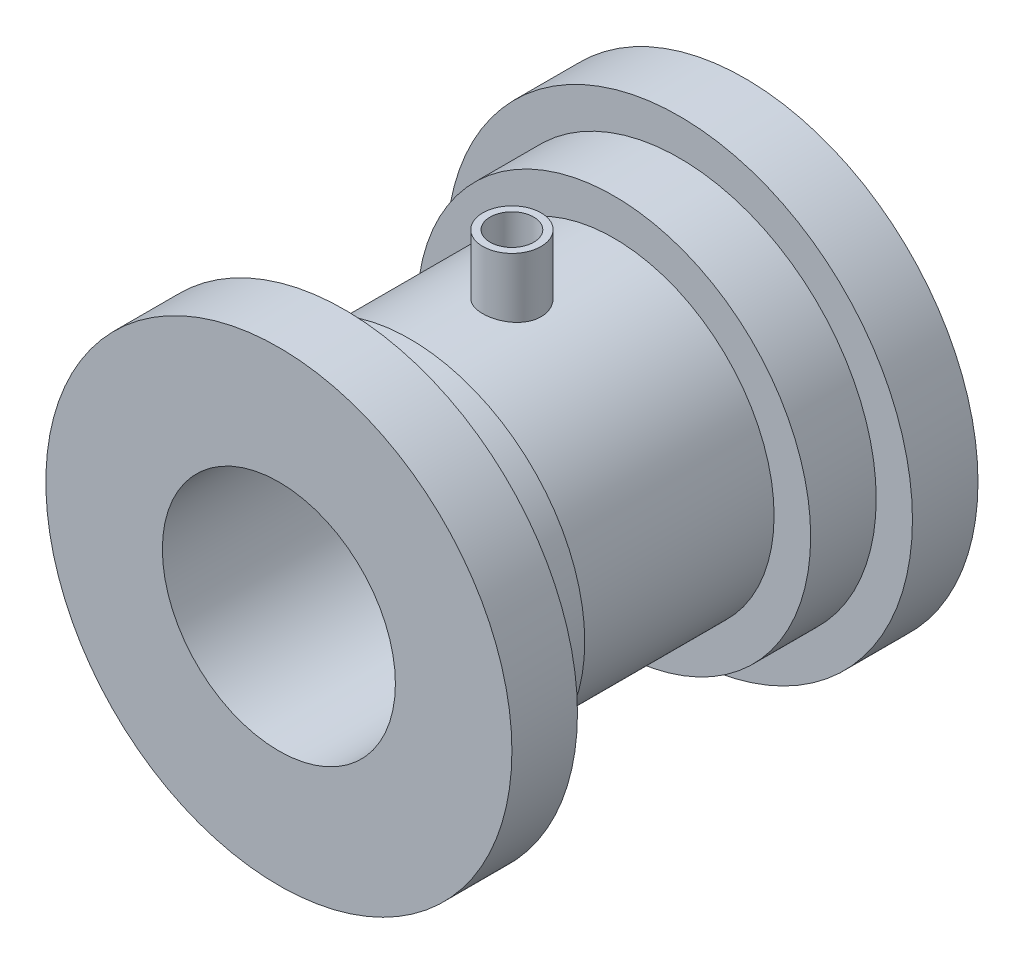
ISO-10303-21;
HEADER;
FILE_DESCRIPTION(('STEP AP214'),'2;1');
FILE_NAME('part.step','',(''),(''),'','','');
FILE_SCHEMA(('AUTOMOTIVE_DESIGN { 1 0 10303 214 1 1 1 1 }'));
ENDSEC;
DATA;
#1=APPLICATION_CONTEXT('core data for automotive mechanical design processes');
#2=APPLICATION_PROTOCOL_DEFINITION('international standard','automotive_design',2000,#1);
#3=PRODUCT_CONTEXT('',#1,'mechanical');
#4=PRODUCT('Part','Part','',(#3));
#5=PRODUCT_RELATED_PRODUCT_CATEGORY('part','',(#4));
#6=PRODUCT_DEFINITION_FORMATION('','',#4);
#7=PRODUCT_DEFINITION_CONTEXT('part definition',#1,'design');
#8=PRODUCT_DEFINITION('design','',#6,#7);
#9=PRODUCT_DEFINITION_SHAPE('','',#8);
#10=(LENGTH_UNIT() NAMED_UNIT(*) SI_UNIT(.MILLI.,.METRE.));
#11=(NAMED_UNIT(*) PLANE_ANGLE_UNIT() SI_UNIT($,.RADIAN.));
#12=(NAMED_UNIT(*) SI_UNIT($,.STERADIAN.) SOLID_ANGLE_UNIT());
#13=UNCERTAINTY_MEASURE_WITH_UNIT(LENGTH_MEASURE(1.E-05),#10,'distance_accuracy_value','');
#14=(GEOMETRIC_REPRESENTATION_CONTEXT(3) GLOBAL_UNCERTAINTY_ASSIGNED_CONTEXT((#13)) GLOBAL_UNIT_ASSIGNED_CONTEXT((#10,
#11,#12)) REPRESENTATION_CONTEXT('',''));
#15=CARTESIAN_POINT('',(0.,0.,0.));
#16=DIRECTION('',(0.,0.,1.));
#17=DIRECTION('',(1.,0.,0.));
#18=AXIS2_PLACEMENT_3D('',#15,#16,#17);
#19=CARTESIAN_POINT('',(0.,0.,0.));
#20=DIRECTION('',(0.,0.,1.));
#21=DIRECTION('',(1.,0.,0.));
#22=AXIS2_PLACEMENT_3D('',#19,#20,#21);
#23=CYLINDRICAL_SURFACE('',#22,22.);
#24=CARTESIAN_POINT('',(0.,-22.,-6.01457708298209));
#25=CARTESIAN_POINT('',(0.167676826859721,-21.9999974934523,-6.01458412189685));
#26=CARTESIAN_POINT('',(0.335455204579492,-21.9980628542975,-6.02868226832721));
#27=CARTESIAN_POINT('',(0.666334195282824,-21.990531328169,-6.08469484943066));
#28=CARTESIAN_POINT('',(0.829429891319714,-21.984930728802,-6.12663748188176));
#29=CARTESIAN_POINT('',(1.14610618738719,-21.9706975479658,-6.23707255066333));
#30=CARTESIAN_POINT('',(1.29969344490645,-21.9620671167838,-6.30554616138626));
#31=CARTESIAN_POINT('',(1.59317060489946,-21.9427314544459,-6.46705613210251));
#32=CARTESIAN_POINT('',(1.73306265771744,-21.9320265498011,-6.56008862749067));
#33=CARTESIAN_POINT('',(1.99611512762449,-21.9096571993851,-6.76872151156672));
#34=CARTESIAN_POINT('',(2.11917356924753,-21.8979875381044,-6.88444992898902));
#35=CARTESIAN_POINT('',(2.34418667816088,-21.8750454311864,-7.13491430456687));
#36=CARTESIAN_POINT('',(2.44614021225599,-21.863773006905,-7.26965128270473));
#37=CARTESIAN_POINT('',(2.62643701049846,-21.8428507554376,-7.55498095943031));
#38=CARTESIAN_POINT('',(2.70468332936807,-21.833207660216,-7.70563545299252));
#39=CARTESIAN_POINT('',(2.83472528970555,-21.8167058813552,-8.01810071372944));
#40=CARTESIAN_POINT('',(2.8865221221597,-21.8098470723459,-8.1799109782017));
#41=CARTESIAN_POINT('',(2.9618818111018,-21.7997409938434,-8.50902957012928));
#42=CARTESIAN_POINT('',(2.98561797729098,-21.7964715644898,-8.67629752156421));
#43=CARTESIAN_POINT('',(3.00471910119333,-21.7938468760964,-9.01247202903025));
#44=CARTESIAN_POINT('',(3.00008540995952,-21.7944914306616,-9.18137850664761));
#45=CARTESIAN_POINT('',(2.9627203403848,-21.7996016067311,-9.5148205341839));
#46=CARTESIAN_POINT('',(2.9301807783518,-21.8040411420393,-9.67937803571644));
#47=CARTESIAN_POINT('',(2.83822735390599,-21.8162003481636,-10.0006751640474));
#48=CARTESIAN_POINT('',(2.77881285300506,-21.8239200969101,-10.157414605008));
#49=CARTESIAN_POINT('',(2.63459283520415,-21.841799165874,-10.4592169350573));
#50=CARTESIAN_POINT('',(2.54970487715522,-21.851966385515,-10.6042399415181));
#51=CARTESIAN_POINT('',(2.35700646089641,-21.8735888866938,-10.8780553807536));
#52=CARTESIAN_POINT('',(2.24919475646083,-21.8850442382436,-11.0068469305156));
#53=CARTESIAN_POINT('',(2.01265055567599,-21.908067947796,-11.2456561919712));
#54=CARTESIAN_POINT('',(1.88375290146845,-21.9196364588217,-11.3555103636069));
#55=CARTESIAN_POINT('',(1.60926188881082,-21.9414949411558,-11.5520500661789));
#56=CARTESIAN_POINT('',(1.46366847832928,-21.9517849084796,-11.6387355249082));
#57=CARTESIAN_POINT('',(1.1597859389609,-21.9699350817542,-11.7864808093422));
#58=CARTESIAN_POINT('',(1.00149126426257,-21.9777942189694,-11.8475293677675));
#59=CARTESIAN_POINT('',(0.676766175879786,-21.9901879040614,-11.9421327588733));
#60=CARTESIAN_POINT('',(0.510336216560258,-21.994722637384,-11.9756891251691));
#61=CARTESIAN_POINT('',(0.175477814735344,-21.9999322760751,-12.0141412521133));
#62=CARTESIAN_POINT('',(0.00707567277568653,-22.0006374938028,-12.0192621001593));
#63=CARTESIAN_POINT('',(-0.328184588178508,-21.9981907754197,-12.0012933263206));
#64=CARTESIAN_POINT('',(-0.495042746360837,-21.9950389374767,-11.9782044224163));
#65=CARTESIAN_POINT('',(-0.821806756729893,-21.9852510531583,-11.9046586365628));
#66=CARTESIAN_POINT('',(-0.981737441241117,-21.9786288024664,-11.8543100918394));
#67=CARTESIAN_POINT('',(-1.29088628219117,-21.9626408812727,-11.7277875649163));
#68=CARTESIAN_POINT('',(-1.44010401285043,-21.9532751018062,-11.6516125569477));
#69=CARTESIAN_POINT('',(-1.72458978596492,-21.9327672607206,-11.475062005534));
#70=CARTESIAN_POINT('',(-1.85976745670649,-21.921614741142,-11.3745420773813));
#71=CARTESIAN_POINT('',(-2.11141402650921,-21.8988110628535,-11.1523579270674));
#72=CARTESIAN_POINT('',(-2.22788203490664,-21.8871598804385,-11.0306926988688));
#73=CARTESIAN_POINT('',(-2.43961065908225,-21.8645773754606,-10.7686754169653));
#74=CARTESIAN_POINT('',(-2.53472132761283,-21.8536515002427,-10.6282016560199));
#75=CARTESIAN_POINT('',(-2.69999679098531,-21.8338493008832,-10.3331404675826));
#76=CARTESIAN_POINT('',(-2.77016216392283,-21.8249729292469,-10.1785533672649));
#77=CARTESIAN_POINT('',(-2.88331699010305,-21.8103129452134,-9.86012156963571));
#78=CARTESIAN_POINT('',(-2.92638854100027,-21.8045199979441,-9.69630649410982));
#79=CARTESIAN_POINT('',(-2.98439621095037,-21.7966568632046,-9.36368403932602));
#80=CARTESIAN_POINT('',(-2.99933390995801,-21.7945864666819,-9.19487694095338));
#81=CARTESIAN_POINT('',(-3.00061713169436,-21.7944097083055,-8.85855513220017));
#82=CARTESIAN_POINT('',(-2.98719829381274,-21.796270677241,-8.69104128976529));
#83=CARTESIAN_POINT('',(-2.93265092877067,-21.8036764010729,-8.36067480558512));
#84=CARTESIAN_POINT('',(-2.89152241742378,-21.809221153867,-8.19782216117978));
#85=CARTESIAN_POINT('',(-2.7828011290096,-21.8233590163958,-7.88144680421181));
#86=CARTESIAN_POINT('',(-2.71522193961382,-21.8319505607859,-7.72791934801702));
#87=CARTESIAN_POINT('',(-2.5555407967824,-21.85121622249,-7.43434448576937));
#88=CARTESIAN_POINT('',(-2.46343830731648,-21.8618903853246,-7.29429737446099));
#89=CARTESIAN_POINT('',(-2.25645830446166,-21.884224598437,-7.03045700978252));
#90=CARTESIAN_POINT('',(-2.14140556846805,-21.8958918112072,-6.90680181053707));
#91=CARTESIAN_POINT('',(-1.89215973610725,-21.9188357460712,-6.68046638956053));
#92=CARTESIAN_POINT('',(-1.7579621639157,-21.9301123760831,-6.57779108635936));
#93=CARTESIAN_POINT('',(-1.473530986404,-21.9510618593984,-6.39592514821537));
#94=CARTESIAN_POINT('',(-1.32322763703472,-21.9607272329125,-6.31684276642944));
#95=CARTESIAN_POINT('',(-1.01141938786063,-21.9772907411432,-6.18515812087614));
#96=CARTESIAN_POINT('',(-0.849926624043753,-21.9841918205545,-6.13252766359469));
#97=CARTESIAN_POINT('',(-0.573037194174379,-21.9928235213462,-6.0675562088542));
#98=CARTESIAN_POINT('',(-0.459371577392146,-21.9955012855773,-6.0477183613874));
#99=CARTESIAN_POINT('',(-0.230486627293774,-21.9990903781477,-6.02122644101966));
#100=CARTESIAN_POINT('',(-0.1152673085954,-22.0000017230944,-6.01457224416939));
#101=CARTESIAN_POINT('',(0.,-22.,-6.01457708298209));
#102=B_SPLINE_CURVE_WITH_KNOTS('',3,(#24,#25,#26,#27,#28,#29,#30,#31,#32,#33,#34,#35,#36,#37,
#38,#39,#40,#41,#42,#43,#44,#45,#46,#47,#48,#49,#50,#51,#52,#53,#54,#55,#56,#57,#58,#59,#60,#61,
#62,#63,#64,#65,#66,#67,#68,#69,#70,#71,#72,#73,#74,#75,#76,#77,#78,#79,#80,#81,#82,#83,#84,#85,
#86,#87,#88,#89,#90,#91,#92,#93,#94,#95,#96,#97,#98,#99,#100,#101),.UNSPECIFIED.,.T.,.F.,(4,2,2,
2,2,2,2,2,2,2,2,2,2,2,2,2,2,2,2,2,2,2,2,2,2,2,2,2,2,2,2,2,2,2,2,2,2,2,4),(0.,0.502609376172301,
1.00572851685898,1.50849131075064,2.0111750366105,2.51678051739006,3.02241313883223,
3.53008635854344,4.03773671636778,4.54223504001235,5.04670933820383,5.54774357745448,
6.04878972077749,6.55147524370068,7.05418810159108,7.56104569493679,8.06790486792019,
8.57498657022924,9.08203998373342,9.58507392409649,10.0880950617602,10.5891315761909,
11.0901879929896,11.5942921539578,12.0984203054351,12.6059843025882,13.1135365364146,
13.619543320099,14.1255216863572,14.6273119749012,15.1291019770798,15.6306345481248,
16.1321780825684,16.6377084708874,17.1433572401882,17.6512916404935,18.1586835098852,
18.5041992012525,18.8497116441535),.UNSPECIFIED.);
#103=CARTESIAN_POINT('',(0.,-22.,-6.01457708298209));
#104=VERTEX_POINT('',#103);
#105=EDGE_CURVE('E116',#104,#104,#102,.T.);
#106=ORIENTED_EDGE('',*,*,#105,.T.);
#107=EDGE_LOOP('',(#106));
#108=FACE_BOUND('',#107,.T.);
#109=CARTESIAN_POINT('',(0.,0.,-23.0145770829821));
#110=DIRECTION('',(0.,0.,1.));
#111=DIRECTION('',(1.,0.,0.));
#112=AXIS2_PLACEMENT_3D('',#109,#110,#111);
#113=CIRCLE('',#112,22.);
#114=CARTESIAN_POINT('',(22.,0.,-23.0145770829821));
#115=VERTEX_POINT('',#114);
#116=EDGE_CURVE('E58',#115,#115,#113,.T.);
#117=ORIENTED_EDGE('',*,*,#116,.T.);
#118=EDGE_LOOP('',(#117));
#119=FACE_BOUND('',#118,.T.);
#120=CARTESIAN_POINT('',(0.,0.,4.9854229170179));
#121=DIRECTION('',(0.,0.,1.));
#122=DIRECTION('',(1.,0.,0.));
#123=AXIS2_PLACEMENT_3D('',#120,#121,#122);
#124=CIRCLE('',#123,22.);
#125=CARTESIAN_POINT('',(22.,0.,4.9854229170179));
#126=VERTEX_POINT('',#125);
#127=EDGE_CURVE('E55',#126,#126,#124,.T.);
#128=ORIENTED_EDGE('',*,*,#127,.F.);
#129=EDGE_LOOP('',(#128));
#130=FACE_BOUND('',#129,.T.);
#131=CARTESIAN_POINT('',(0.,22.,-5.01457708298209));
#132=CARTESIAN_POINT('',(-0.222714543288746,21.9999960145572,-5.01458572030345));
#133=CARTESIAN_POINT('',(-0.445542899836405,21.9965830546687,-5.03324059794739));
#134=CARTESIAN_POINT('',(-0.884928813696618,21.9832969500399,-5.10732401503194));
#135=CARTESIAN_POINT('',(-1.10148077453215,21.9734182144508,-5.16278438014483));
#136=CARTESIAN_POINT('',(-1.5218951450275,21.9483064647013,-5.30873134232406));
#137=CARTESIAN_POINT('',(-1.72576852786035,21.9330781586384,-5.39918714736162));
#138=CARTESIAN_POINT('',(-2.115424006769,21.898933429966,-5.61247174536567));
#139=CARTESIAN_POINT('',(-2.30120773535809,21.8800173406264,-5.73529761335848));
#140=CARTESIAN_POINT('',(-2.65152888102477,21.8403486699966,-6.0113089022675));
#141=CARTESIAN_POINT('',(-2.81583245206691,21.8195794519416,-6.16478876694361));
#142=CARTESIAN_POINT('',(-3.11650714682158,21.7786699042361,-6.49711779116174));
#143=CARTESIAN_POINT('',(-3.25287633589955,21.7585296182252,-6.67596870636039));
#144=CARTESIAN_POINT('',(-3.49477390032954,21.7209968041953,-7.05560254190164));
#145=CARTESIAN_POINT('',(-3.60006626531112,21.703625742202,-7.25653815344284));
#146=CARTESIAN_POINT('',(-3.77531093899957,21.673831665538,-7.67361438363003));
#147=CARTESIAN_POINT('',(-3.8452661056655,21.6614082507349,-7.88975377103217));
#148=CARTESIAN_POINT('',(-3.9471039542263,21.6430830703341,-8.32860638169529));
#149=CARTESIAN_POINT('',(-3.97939332850889,21.6371116924469,-8.55122226640134));
#150=CARTESIAN_POINT('',(-4.00624497473377,21.6321566286462,-8.99878589761123));
#151=CARTESIAN_POINT('',(-4.00081042593285,21.633172353881,-9.22373344601415));
#152=CARTESIAN_POINT('',(-3.95269868854,21.6420133009836,-9.66664091124813));
#153=CARTESIAN_POINT('',(-3.91048235398144,21.6497542562853,-9.88465281877353));
#154=CARTESIAN_POINT('',(-3.79073046680053,21.6710412254782,-10.3104471197164));
#155=CARTESIAN_POINT('',(-3.71319349486376,21.6845874726464,-10.5182291016857));
#156=CARTESIAN_POINT('',(-3.52454595578591,21.7160476310543,-10.9190226645396));
#157=CARTESIAN_POINT('',(-3.41324780743079,21.733985834287,-11.1119439683143));
#158=CARTESIAN_POINT('',(-3.16037006748085,21.7721924402343,-11.4765465568727));
#159=CARTESIAN_POINT('',(-3.01878758047169,21.7924610656694,-11.6482258082746));
#160=CARTESIAN_POINT('',(-2.70686798836704,21.8334128161709,-11.9681350758708));
#161=CARTESIAN_POINT('',(-2.53613634531379,21.8540976363293,-12.1159804598559));
#162=CARTESIAN_POINT('',(-2.17208908138662,21.8932750087418,-12.3809873499438));
#163=CARTESIAN_POINT('',(-1.97877325899631,21.9117675414312,-12.4981485822246));
#164=CARTESIAN_POINT('',(-1.57465519699459,21.9445107565068,-12.6985118625521));
#165=CARTESIAN_POINT('',(-1.36383356079098,21.9587566511844,-12.781675620374));
#166=CARTESIAN_POINT('',(-0.930896828925333,21.9813641094176,-12.9113034679695));
#167=CARTESIAN_POINT('',(-0.708782862632129,21.9897262601819,-12.9577712201299));
#168=CARTESIAN_POINT('',(-0.262877299156997,21.9995438675732,-13.0121566068203));
#169=CARTESIAN_POINT('',(-0.0391520242178671,22.0010937868229,-13.0206015298903));
#170=CARTESIAN_POINT('',(0.406514477941935,21.99737260495,-13.0001134866191));
#171=CARTESIAN_POINT('',(0.628455786906164,21.9921018181742,-12.9711822428386));
#172=CARTESIAN_POINT('',(1.06259419518551,21.975390172649,-12.8772015838583));
#173=CARTESIAN_POINT('',(1.27485059491663,21.9639946314432,-12.8124173446164));
#174=CARTESIAN_POINT('',(1.68548942751322,21.9363059024444,-12.6488554259382));
#175=CARTESIAN_POINT('',(1.8838709619219,21.9200123978487,-12.5500755475867));
#176=CARTESIAN_POINT('',(2.26339049414987,21.8840995916968,-12.3201478073762));
#177=CARTESIAN_POINT('',(2.44432890416976,21.864447632292,-12.1886757086702));
#178=CARTESIAN_POINT('',(2.78176427644694,21.8240857614217,-11.8975363296399));
#179=CARTESIAN_POINT('',(2.93825909948664,21.8033757575701,-11.7378665841582));
#180=CARTESIAN_POINT('',(3.22435475775359,21.7629207911529,-11.3924833200851));
#181=CARTESIAN_POINT('',(3.35359673482837,21.7431910424377,-11.2064704699304));
#182=CARTESIAN_POINT('',(3.57899973104027,21.7072302016204,-10.8150647201691));
#183=CARTESIAN_POINT('',(3.6751619326159,21.6909989844708,-10.6096725136133));
#184=CARTESIAN_POINT('',(3.83115890483493,21.6639908923095,-10.1862755835986));
#185=CARTESIAN_POINT('',(3.8911621572368,21.653188760335,-9.96833462150598));
#186=CARTESIAN_POINT('',(3.97366080357107,21.6382025309078,-9.52525110571995));
#187=CARTESIAN_POINT('',(3.99616014907258,21.6340177362272,-9.30010931328425));
#188=CARTESIAN_POINT('',(4.00288627326368,21.6327738776523,-8.85260633205482));
#189=CARTESIAN_POINT('',(3.98767874002465,21.6356094908823,-8.63025374010501));
#190=CARTESIAN_POINT('',(3.92065693825629,21.6478541749405,-8.19132980694726));
#191=CARTESIAN_POINT('',(3.86884285811435,21.6572632119402,-7.97475843599352));
#192=CARTESIAN_POINT('',(3.73031134316953,21.6815514416183,-7.55382468819135));
#193=CARTESIAN_POINT('',(3.64365162038464,21.6964215859949,-7.34944276253522));
#194=CARTESIAN_POINT('',(3.43794947329646,21.7299635502969,-6.95802818865262));
#195=CARTESIAN_POINT('',(3.31890495138014,21.7486356164588,-6.77099666529092));
#196=CARTESIAN_POINT('',(3.04983087325598,21.7880064930293,-6.41675133379084));
#197=CARTESIAN_POINT('',(2.89938831106199,21.8087301566221,-6.24985394324056));
#198=CARTESIAN_POINT('',(2.57265302846728,21.849679841373,-5.94348292095771));
#199=CARTESIAN_POINT('',(2.39635437360186,21.8699057470383,-5.8040156021976));
#200=CARTESIAN_POINT('',(2.0211423792926,21.9077794859438,-5.55537648873511));
#201=CARTESIAN_POINT('',(1.82205169958099,21.9254042634686,-5.44646871262183));
#202=CARTESIAN_POINT('',(1.40814781017269,21.9558652198669,-5.26381865083398));
#203=CARTESIAN_POINT('',(1.19334985097334,21.9687059716947,-5.19004276442546));
#204=CARTESIAN_POINT('',(0.814883498916811,21.9854814075298,-5.09502622237771));
#205=CARTESIAN_POINT('',(0.653450854552978,21.9908956054717,-5.06490841706138));
#206=CARTESIAN_POINT('',(0.328032684264405,21.9981563286609,-5.02468089539229));
#207=CARTESIAN_POINT('',(0.164047216881665,22.0000029356,-5.01457072089855));
#208=CARTESIAN_POINT('',(0.,22.,-5.01457708298209));
#209=B_SPLINE_CURVE_WITH_KNOTS('',3,(#131,#132,#133,#134,#135,#136,#137,#138,#139,#140,#141,
#142,#143,#144,#145,#146,#147,#148,#149,#150,#151,#152,#153,#154,#155,#156,#157,#158,#159,#160,
#161,#162,#163,#164,#165,#166,#167,#168,#169,#170,#171,#172,#173,#174,#175,#176,#177,#178,#179,
#180,#181,#182,#183,#184,#185,#186,#187,#188,#189,#190,#191,#192,#193,#194,#195,#196,#197,#198,
#199,#200,#201,#202,#203,#204,#205,#206,#207,#208),.UNSPECIFIED.,.T.,.F.,(4,2,2,2,2,2,2,2,2,2,2,
2,2,2,2,2,2,2,2,2,2,2,2,2,2,2,2,2,2,2,2,2,2,2,2,2,2,2,4),(0.,0.667543783104664,1.33566554414518,
2.00320076573349,2.67067568920301,3.34490029193771,4.01917157326157,4.698439044073,
5.37765156911461,6.0494604234529,6.72121266048405,7.3846673458179,8.04814869357741,
8.7153861292325,9.38268738642509,10.0598642088374,10.7370470740929,11.4149905404762,
12.0928663372291,12.7613120199473,13.4297268970159,14.0932628657086,14.7568417614844,
15.4272845359133,16.0977859523225,16.7766301226092,17.4554500250495,18.1310820215231,
18.806642826072,19.4721301946074,20.1376141383862,20.8020004051792,21.4664297155381,
22.1402222906008,22.8141697565893,23.4937720908585,24.1727231299633,24.6644342045912,
25.1561340197353),.UNSPECIFIED.);
#210=CARTESIAN_POINT('',(0.,22.,-5.01457708298209));
#211=VERTEX_POINT('',#210);
#212=EDGE_CURVE('E76',#211,#211,#209,.T.);
#213=ORIENTED_EDGE('',*,*,#212,.T.);
#214=EDGE_LOOP('',(#213));
#215=FACE_BOUND('',#214,.T.);
#216=ADVANCED_FACE('F31',(#108,#119,#130,#215),#23,.T.);
#217=CARTESIAN_POINT('',(0.,0.,0.));
#218=DIRECTION('',(0.,0.,1.));
#219=DIRECTION('',(1.,0.,0.));
#220=AXIS2_PLACEMENT_3D('',#217,#218,#219);
#221=CYLINDRICAL_SURFACE('',#220,16.);
#222=CARTESIAN_POINT('',(0.,-16.,-6.01457708298209));
#223=CARTESIAN_POINT('',(-0.166943492930942,-15.999996976677,-6.01458346215864));
#224=CARTESIAN_POINT('',(-0.333969985460197,-15.9973601984343,-6.02855923622085));
#225=CARTESIAN_POINT('',(-0.663316259683595,-15.9870957178104,-6.08405707321878));
#226=CARTESIAN_POINT('',(-0.825631948304451,-15.9794638033379,-6.12560238426156));
#227=CARTESIAN_POINT('',(-1.1407459237036,-15.9600627753092,-6.23492248550077));
#228=CARTESIAN_POINT('',(-1.29355266137069,-15.9482973989297,-6.30267358788717));
#229=CARTESIAN_POINT('',(-1.58561594618801,-15.9219142119957,-6.46241483682772));
#230=CARTESIAN_POINT('',(-1.72487358895465,-15.9072966323658,-6.55440302127173));
#231=CARTESIAN_POINT('',(-1.987567431861,-15.8766267286101,-6.76117661898944));
#232=CARTESIAN_POINT('',(-2.11081791006366,-15.860560697127,-6.87619597232236));
#233=CARTESIAN_POINT('',(-2.33639212270738,-15.828906369173,-7.12526370115721));
#234=CARTESIAN_POINT('',(-2.43871435378483,-15.8133181070905,-7.25931344252066));
#235=CARTESIAN_POINT('',(-2.62029997331586,-15.7842510249001,-7.54394925971003));
#236=CARTESIAN_POINT('',(-2.69937443939211,-15.7707898777236,-7.69465782361656));
#237=CARTESIAN_POINT('',(-2.83101048664566,-15.7476942642397,-8.00751491333567));
#238=CARTESIAN_POINT('',(-2.88357435426196,-15.7380594679392,-8.16966245120452));
#239=CARTESIAN_POINT('',(-2.96010107007,-15.723845391491,-8.49880754481091));
#240=CARTESIAN_POINT('',(-2.98438780384078,-15.7192089073281,-8.66572727738901));
#241=CARTESIAN_POINT('',(-3.00467616190693,-15.7153439430552,-9.00133185259858));
#242=CARTESIAN_POINT('',(-3.00068032270748,-15.7161149779752,-9.17001653558669));
#243=CARTESIAN_POINT('',(-2.96477959204725,-15.7229258540351,-9.50201613351418));
#244=CARTESIAN_POINT('',(-2.9332429999209,-15.7288961629467,-9.66537251158239));
#245=CARTESIAN_POINT('',(-2.84373598792414,-15.7453236656933,-9.9844339225473));
#246=CARTESIAN_POINT('',(-2.78576444478999,-15.7557810501903,-10.1401386300007));
#247=CARTESIAN_POINT('',(-2.644672943586,-15.7800771058518,-10.4405544409826));
#248=CARTESIAN_POINT('',(-2.56140427064912,-15.7939356764673,-10.5851940241437));
#249=CARTESIAN_POINT('',(-2.37218737860833,-15.8234594320584,-10.8585865400626));
#250=CARTESIAN_POINT('',(-2.26623685778532,-15.8391248003104,-10.9873378584117));
#251=CARTESIAN_POINT('',(-2.03267811370595,-15.8708000254433,-11.227426994327));
#252=CARTESIAN_POINT('',(-1.90475487372137,-15.8868114204806,-11.3384583878856));
#253=CARTESIAN_POINT('',(-1.63193607419765,-15.9171477221664,-11.5375315643329));
#254=CARTESIAN_POINT('',(-1.48704034451154,-15.9314726119049,-11.6255731167229));
#255=CARTESIAN_POINT('',(-1.18406997774934,-15.9568507935502,-11.7762125907221));
#256=CARTESIAN_POINT('',(-1.02597912889299,-15.9678999827258,-11.8387786412179));
#257=CARTESIAN_POINT('',(-0.701278230797395,-15.9854501080544,-11.9363812691664));
#258=CARTESIAN_POINT('',(-0.534669088555576,-15.9919515273599,-11.9714207710728));
#259=CARTESIAN_POINT('',(-0.200297305806772,-15.9996072128396,-12.0125491450186));
#260=CARTESIAN_POINT('',(-0.0325880252682724,-16.0008390182456,-12.0190578660415));
#261=CARTESIAN_POINT('',(0.301522496184366,-15.9980308719646,-12.0040661238868));
#262=CARTESIAN_POINT('',(0.467923800960769,-15.9939911792886,-11.9825670368516));
#263=CARTESIAN_POINT('',(0.793363146436432,-15.9811422300081,-11.9125190126154));
#264=CARTESIAN_POINT('',(0.952448522092125,-15.9723704474806,-11.8641825179065));
#265=CARTESIAN_POINT('',(1.26025726364926,-15.95103684425,-11.7420616694245));
#266=CARTESIAN_POINT('',(1.4089799251902,-15.9384747662267,-11.6682755878505));
#267=CARTESIAN_POINT('',(1.69363334302643,-15.9107606071533,-11.4964208266631));
#268=CARTESIAN_POINT('',(1.82940655403024,-15.8955817234913,-11.3980956059084));
#269=CARTESIAN_POINT('',(2.08267664652909,-15.8643868697942,-11.1803008082574));
#270=CARTESIAN_POINT('',(2.20017181952173,-15.8483708216937,-11.0608292569794));
#271=CARTESIAN_POINT('',(2.41514591744096,-15.817049513949,-10.8022324451592));
#272=CARTESIAN_POINT('',(2.51233832437153,-15.8017565172051,-10.6628672667313));
#273=CARTESIAN_POINT('',(2.68193350115574,-15.7738597115706,-10.3695418339346));
#274=CARTESIAN_POINT('',(2.75433719227848,-15.761255802747,-10.2155821222411));
#275=CARTESIAN_POINT('',(2.87189347025646,-15.7402604841915,-9.89816534849702));
#276=CARTESIAN_POINT('',(2.91717737589572,-15.7318488087376,-9.73475832386343));
#277=CARTESIAN_POINT('',(2.97961358652471,-15.7201440760483,-9.40248263793929));
#278=CARTESIAN_POINT('',(2.99676906541416,-15.7168504413158,-9.23361459504129));
#279=CARTESIAN_POINT('',(3.00235524296709,-15.7157839960771,-8.89808042009907));
#280=CARTESIAN_POINT('',(2.99123790006998,-15.7179243194859,-8.7314219210681));
#281=CARTESIAN_POINT('',(2.94158350757606,-15.7272920132,-8.40239423889152));
#282=CARTESIAN_POINT('',(2.90304662178664,-15.7345193531149,-8.24002503012721));
#283=CARTESIAN_POINT('',(2.79983775166526,-15.7532101604636,-7.92442811339113));
#284=CARTESIAN_POINT('',(2.73521470794505,-15.7646656918993,-7.77118390029055));
#285=CARTESIAN_POINT('',(2.58171737824409,-15.7905277510368,-7.4776405745004));
#286=CARTESIAN_POINT('',(2.49284137896371,-15.8049344872024,-7.33734237729253));
#287=CARTESIAN_POINT('',(2.2917897467907,-15.8353453221549,-7.0714097228975));
#288=CARTESIAN_POINT('',(2.17928519728607,-15.8513701070609,-6.94602625784788));
#289=CARTESIAN_POINT('',(1.93485585348458,-15.8830566783747,-6.71576675805304));
#290=CARTESIAN_POINT('',(1.80292660378323,-15.8987183805466,-6.61089544102182));
#291=CARTESIAN_POINT('',(1.52196989014375,-15.928079519361,-6.42375517772797));
#292=CARTESIAN_POINT('',(1.37279918128104,-15.9417600198112,-6.34169822600081));
#293=CARTESIAN_POINT('',(1.06258022730767,-15.9654323876137,-6.20394180977182));
#294=CARTESIAN_POINT('',(0.901543303410498,-15.9754277175807,-6.14821758888827));
#295=CARTESIAN_POINT('',(0.61669440565031,-15.9885658141526,-6.07602245414474));
#296=CARTESIAN_POINT('',(0.494547620503744,-15.9928294175641,-6.05301982235649));
#297=CARTESIAN_POINT('',(0.248282494230318,-15.9985475990802,-6.0222949587492));
#298=CARTESIAN_POINT('',(0.12416420330542,-16.0000022485961,-6.01457233847027));
#299=CARTESIAN_POINT('',(0.,-16.,-6.01457708298209));
#300=B_SPLINE_CURVE_WITH_KNOTS('',3,(#222,#223,#224,#225,#226,#227,#228,#229,#230,#231,#232,
#233,#234,#235,#236,#237,#238,#239,#240,#241,#242,#243,#244,#245,#246,#247,#248,#249,#250,#251,
#252,#253,#254,#255,#256,#257,#258,#259,#260,#261,#262,#263,#264,#265,#266,#267,#268,#269,#270,
#271,#272,#273,#274,#275,#276,#277,#278,#279,#280,#281,#282,#283,#284,#285,#286,#287,#288,#289,
#290,#291,#292,#293,#294,#295,#296,#297,#298,#299),.UNSPECIFIED.,.T.,.F.,(4,2,2,2,2,2,2,2,2,2,2,
2,2,2,2,2,2,2,2,2,2,2,2,2,2,2,2,2,2,2,2,2,2,2,2,2,2,2,4),(0.,0.500376401929848,1.0011752850709,
1.50152254246181,2.00182930673781,2.50750236027261,3.01321172567233,3.52292381008715,
4.03259192623897,4.53636302890671,5.04008895174512,5.53718001225531,6.03429219693573,
6.53438525259061,7.03452908099719,7.54255536928154,8.05058675089895,8.55925176643397,
9.06786273347491,9.56896348152193,10.0700396092917,10.5672046781566,11.0644035067606,
11.5670355603542,12.069714568262,12.579068739746,13.0884039790989,13.5952525563712,
14.1020439389303,14.600785044635,15.0995231708301,15.5973299241538,16.0951718531085,
16.6004673993276,17.1058790252451,17.6158409783263,18.1253225386235,18.4974868904882,
18.8696417807908),.UNSPECIFIED.);
#301=CARTESIAN_POINT('',(0.,-16.,-6.01457708298209));
#302=VERTEX_POINT('',#301);
#303=EDGE_CURVE('E122',#302,#302,#300,.T.);
#304=ORIENTED_EDGE('',*,*,#303,.T.);
#305=EDGE_LOOP('',(#304));
#306=FACE_BOUND('',#305,.T.);
#307=CARTESIAN_POINT('',(0.,16.,-6.01457708298209));
#308=CARTESIAN_POINT('',(0.166943492930942,15.999996976677,-6.01458346215864));
#309=CARTESIAN_POINT('',(0.333969985460197,15.9973601984343,-6.02855923622085));
#310=CARTESIAN_POINT('',(0.663316259683595,15.9870957178104,-6.08405707321878));
#311=CARTESIAN_POINT('',(0.825631948304451,15.9794638033379,-6.12560238426156));
#312=CARTESIAN_POINT('',(1.1407459237036,15.9600627753092,-6.23492248550077));
#313=CARTESIAN_POINT('',(1.29355266137069,15.9482973989297,-6.30267358788717));
#314=CARTESIAN_POINT('',(1.58561594618801,15.9219142119957,-6.46241483682772));
#315=CARTESIAN_POINT('',(1.72487358895465,15.9072966323658,-6.55440302127173));
#316=CARTESIAN_POINT('',(1.987567431861,15.8766267286101,-6.76117661898944));
#317=CARTESIAN_POINT('',(2.11081791006366,15.860560697127,-6.87619597232236));
#318=CARTESIAN_POINT('',(2.33639212270738,15.828906369173,-7.12526370115721));
#319=CARTESIAN_POINT('',(2.43871435378483,15.8133181070905,-7.25931344252066));
#320=CARTESIAN_POINT('',(2.62029997331586,15.7842510249001,-7.54394925971003));
#321=CARTESIAN_POINT('',(2.69937443939211,15.7707898777236,-7.69465782361656));
#322=CARTESIAN_POINT('',(2.83101048664566,15.7476942642397,-8.00751491333567));
#323=CARTESIAN_POINT('',(2.88357435426196,15.7380594679392,-8.16966245120452));
#324=CARTESIAN_POINT('',(2.96010107007,15.723845391491,-8.49880754481091));
#325=CARTESIAN_POINT('',(2.98438780384078,15.7192089073281,-8.66572727738901));
#326=CARTESIAN_POINT('',(3.00467616190693,15.7153439430552,-9.00133185259858));
#327=CARTESIAN_POINT('',(3.00068032270748,15.7161149779752,-9.17001653558669));
#328=CARTESIAN_POINT('',(2.96477959204725,15.7229258540351,-9.50201613351418));
#329=CARTESIAN_POINT('',(2.9332429999209,15.7288961629467,-9.66537251158239));
#330=CARTESIAN_POINT('',(2.84373598792414,15.7453236656933,-9.9844339225473));
#331=CARTESIAN_POINT('',(2.78576444478999,15.7557810501903,-10.1401386300007));
#332=CARTESIAN_POINT('',(2.644672943586,15.7800771058518,-10.4405544409826));
#333=CARTESIAN_POINT('',(2.56140427064912,15.7939356764673,-10.5851940241437));
#334=CARTESIAN_POINT('',(2.37218737860833,15.8234594320584,-10.8585865400626));
#335=CARTESIAN_POINT('',(2.26623685778532,15.8391248003104,-10.9873378584117));
#336=CARTESIAN_POINT('',(2.03267811370595,15.8708000254433,-11.227426994327));
#337=CARTESIAN_POINT('',(1.90475487372137,15.8868114204806,-11.3384583878856));
#338=CARTESIAN_POINT('',(1.63193607419765,15.9171477221664,-11.5375315643329));
#339=CARTESIAN_POINT('',(1.48704034451154,15.9314726119049,-11.6255731167229));
#340=CARTESIAN_POINT('',(1.18406997774934,15.9568507935502,-11.7762125907221));
#341=CARTESIAN_POINT('',(1.02597912889299,15.9678999827258,-11.8387786412179));
#342=CARTESIAN_POINT('',(0.701278230797395,15.9854501080544,-11.9363812691664));
#343=CARTESIAN_POINT('',(0.534669088555576,15.9919515273599,-11.9714207710728));
#344=CARTESIAN_POINT('',(0.200297305806772,15.9996072128396,-12.0125491450186));
#345=CARTESIAN_POINT('',(0.0325880252682724,16.0008390182456,-12.0190578660415));
#346=CARTESIAN_POINT('',(-0.301522496184366,15.9980308719646,-12.0040661238868));
#347=CARTESIAN_POINT('',(-0.467923800960769,15.9939911792886,-11.9825670368516));
#348=CARTESIAN_POINT('',(-0.793363146436432,15.9811422300081,-11.9125190126154));
#349=CARTESIAN_POINT('',(-0.952448522092125,15.9723704474806,-11.8641825179065));
#350=CARTESIAN_POINT('',(-1.26025726364926,15.95103684425,-11.7420616694245));
#351=CARTESIAN_POINT('',(-1.4089799251902,15.9384747662267,-11.6682755878505));
#352=CARTESIAN_POINT('',(-1.69363334302643,15.9107606071533,-11.4964208266631));
#353=CARTESIAN_POINT('',(-1.82940655403024,15.8955817234913,-11.3980956059084));
#354=CARTESIAN_POINT('',(-2.08267664652909,15.8643868697942,-11.1803008082574));
#355=CARTESIAN_POINT('',(-2.20017181952173,15.8483708216937,-11.0608292569794));
#356=CARTESIAN_POINT('',(-2.41514591744096,15.817049513949,-10.8022324451592));
#357=CARTESIAN_POINT('',(-2.51233832437153,15.8017565172051,-10.6628672667313));
#358=CARTESIAN_POINT('',(-2.68193350115574,15.7738597115706,-10.3695418339346));
#359=CARTESIAN_POINT('',(-2.75433719227848,15.761255802747,-10.2155821222411));
#360=CARTESIAN_POINT('',(-2.87189347025646,15.7402604841915,-9.89816534849702));
#361=CARTESIAN_POINT('',(-2.91717737589572,15.7318488087376,-9.73475832386343));
#362=CARTESIAN_POINT('',(-2.97961358652471,15.7201440760483,-9.40248263793929));
#363=CARTESIAN_POINT('',(-2.99676906541416,15.7168504413158,-9.23361459504129));
#364=CARTESIAN_POINT('',(-3.00235524296709,15.7157839960771,-8.89808042009907));
#365=CARTESIAN_POINT('',(-2.99123790006998,15.7179243194859,-8.7314219210681));
#366=CARTESIAN_POINT('',(-2.94158350757606,15.7272920132,-8.40239423889152));
#367=CARTESIAN_POINT('',(-2.90304662178664,15.7345193531149,-8.24002503012721));
#368=CARTESIAN_POINT('',(-2.79983775166526,15.7532101604636,-7.92442811339113));
#369=CARTESIAN_POINT('',(-2.73521470794505,15.7646656918993,-7.77118390029055));
#370=CARTESIAN_POINT('',(-2.58171737824409,15.7905277510368,-7.4776405745004));
#371=CARTESIAN_POINT('',(-2.49284137896371,15.8049344872024,-7.33734237729253));
#372=CARTESIAN_POINT('',(-2.2917897467907,15.8353453221549,-7.0714097228975));
#373=CARTESIAN_POINT('',(-2.17928519728607,15.8513701070609,-6.94602625784788));
#374=CARTESIAN_POINT('',(-1.93485585348458,15.8830566783747,-6.71576675805304));
#375=CARTESIAN_POINT('',(-1.80292660378323,15.8987183805466,-6.61089544102182));
#376=CARTESIAN_POINT('',(-1.52196989014375,15.928079519361,-6.42375517772797));
#377=CARTESIAN_POINT('',(-1.37279918128104,15.9417600198112,-6.34169822600081));
#378=CARTESIAN_POINT('',(-1.06258022730767,15.9654323876137,-6.20394180977182));
#379=CARTESIAN_POINT('',(-0.901543303410498,15.9754277175807,-6.14821758888827));
#380=CARTESIAN_POINT('',(-0.61669440565031,15.9885658141526,-6.07602245414474));
#381=CARTESIAN_POINT('',(-0.494547620503744,15.9928294175641,-6.05301982235649));
#382=CARTESIAN_POINT('',(-0.248282494230318,15.9985475990802,-6.0222949587492));
#383=CARTESIAN_POINT('',(-0.12416420330542,16.0000022485961,-6.01457233847027));
#384=CARTESIAN_POINT('',(0.,16.,-6.01457708298209));
#385=B_SPLINE_CURVE_WITH_KNOTS('',3,(#307,#308,#309,#310,#311,#312,#313,#314,#315,#316,#317,
#318,#319,#320,#321,#322,#323,#324,#325,#326,#327,#328,#329,#330,#331,#332,#333,#334,#335,#336,
#337,#338,#339,#340,#341,#342,#343,#344,#345,#346,#347,#348,#349,#350,#351,#352,#353,#354,#355,
#356,#357,#358,#359,#360,#361,#362,#363,#364,#365,#366,#367,#368,#369,#370,#371,#372,#373,#374,
#375,#376,#377,#378,#379,#380,#381,#382,#383,#384),.UNSPECIFIED.,.T.,.F.,(4,2,2,2,2,2,2,2,2,2,2,
2,2,2,2,2,2,2,2,2,2,2,2,2,2,2,2,2,2,2,2,2,2,2,2,2,2,2,4),(0.,0.500376401929848,1.0011752850709,
1.50152254246181,2.00182930673781,2.50750236027261,3.01321172567233,3.52292381008715,
4.03259192623897,4.53636302890671,5.04008895174512,5.53718001225531,6.03429219693573,
6.53438525259061,7.03452908099719,7.54255536928154,8.05058675089895,8.55925176643397,
9.06786273347491,9.56896348152193,10.0700396092917,10.5672046781566,11.0644035067606,
11.5670355603542,12.069714568262,12.579068739746,13.0884039790989,13.5952525563712,
14.1020439389303,14.600785044635,15.0995231708301,15.5973299241538,16.0951718531085,
16.6004673993276,17.1058790252451,17.6158409783263,18.1253225386235,18.4974868904882,
18.8696417807908),.UNSPECIFIED.);
#386=CARTESIAN_POINT('',(0.,16.,-6.01457708298209));
#387=VERTEX_POINT('',#386);
#388=EDGE_CURVE('E134',#387,#387,#385,.T.);
#389=ORIENTED_EDGE('',*,*,#388,.T.);
#390=EDGE_LOOP('',(#389));
#391=FACE_BOUND('',#390,.T.);
#392=CARTESIAN_POINT('',(0.,0.,-41.0145770829821));
#393=DIRECTION('',(0.,0.,1.));
#394=DIRECTION('',(1.,0.,0.));
#395=AXIS2_PLACEMENT_3D('',#392,#393,#394);
#396=CIRCLE('',#395,16.);
#397=CARTESIAN_POINT('',(16.,0.,-41.0145770829821));
#398=VERTEX_POINT('',#397);
#399=EDGE_CURVE('E73',#398,#398,#396,.T.);
#400=ORIENTED_EDGE('',*,*,#399,.F.);
#401=EDGE_LOOP('',(#400));
#402=FACE_BOUND('',#401,.T.);
#403=CARTESIAN_POINT('',(0.,0.,22.9854229170179));
#404=DIRECTION('',(0.,0.,1.));
#405=DIRECTION('',(1.,0.,0.));
#406=AXIS2_PLACEMENT_3D('',#403,#404,#405);
#407=CIRCLE('',#406,16.);
#408=CARTESIAN_POINT('',(16.,0.,22.9854229170179));
#409=VERTEX_POINT('',#408);
#410=EDGE_CURVE('E10',#409,#409,#407,.T.);
#411=ORIENTED_EDGE('',*,*,#410,.T.);
#412=EDGE_LOOP('',(#411));
#413=FACE_BOUND('',#412,.T.);
#414=ADVANCED_FACE('F33',(#306,#391,#402,#413),#221,.F.);
#415=CARTESIAN_POINT('',(0.,16.,22.9854229170179));
#416=DIRECTION('',(0.,0.,-1.));
#417=DIRECTION('',(-1.,0.,0.));
#418=AXIS2_PLACEMENT_3D('',#415,#416,#417);
#419=PLANE('',#418);
#420=ORIENTED_EDGE('',*,*,#410,.F.);
#421=EDGE_LOOP('',(#420));
#422=FACE_BOUND('',#421,.T.);
#423=CARTESIAN_POINT('',(0.,0.,22.9854229170179));
#424=DIRECTION('',(0.,0.,1.));
#425=DIRECTION('',(1.,0.,0.));
#426=AXIS2_PLACEMENT_3D('',#423,#424,#425);
#427=CIRCLE('',#426,32.);
#428=CARTESIAN_POINT('',(32.,0.,22.9854229170179));
#429=VERTEX_POINT('',#428);
#430=EDGE_CURVE('E40',#429,#429,#427,.T.);
#431=ORIENTED_EDGE('',*,*,#430,.T.);
#432=EDGE_LOOP('',(#431));
#433=FACE_BOUND('',#432,.T.);
#434=ADVANCED_FACE('F196',(#422,#433),#419,.F.);
#435=CARTESIAN_POINT('',(0.,0.,0.));
#436=DIRECTION('',(0.,0.,1.));
#437=DIRECTION('',(1.,0.,0.));
#438=AXIS2_PLACEMENT_3D('',#435,#436,#437);
#439=CYLINDRICAL_SURFACE('',#438,32.);
#440=ORIENTED_EDGE('',*,*,#430,.F.);
#441=EDGE_LOOP('',(#440));
#442=FACE_BOUND('',#441,.T.);
#443=CARTESIAN_POINT('',(0.,0.,13.9854229170179));
#444=DIRECTION('',(0.,0.,1.));
#445=DIRECTION('',(1.,0.,0.));
#446=AXIS2_PLACEMENT_3D('',#443,#444,#445);
#447=CIRCLE('',#446,32.);
#448=CARTESIAN_POINT('',(32.,0.,13.9854229170179));
#449=VERTEX_POINT('',#448);
#450=EDGE_CURVE('E44',#449,#449,#447,.T.);
#451=ORIENTED_EDGE('',*,*,#450,.T.);
#452=EDGE_LOOP('',(#451));
#453=FACE_BOUND('',#452,.T.);
#454=ADVANCED_FACE('F206',(#442,#453),#439,.T.);
#455=CARTESIAN_POINT('',(0.,32.,13.9854229170179));
#456=DIRECTION('',(0.,0.,1.));
#457=DIRECTION('',(1.,0.,0.));
#458=AXIS2_PLACEMENT_3D('',#455,#456,#457);
#459=PLANE('',#458);
#460=ORIENTED_EDGE('',*,*,#450,.F.);
#461=EDGE_LOOP('',(#460));
#462=FACE_BOUND('',#461,.T.);
#463=CARTESIAN_POINT('',(0.,0.,13.9854229170179));
#464=DIRECTION('',(0.,0.,1.));
#465=DIRECTION('',(1.,0.,0.));
#466=AXIS2_PLACEMENT_3D('',#463,#464,#465);
#467=CIRCLE('',#466,24.);
#468=CARTESIAN_POINT('',(24.,0.,13.9854229170179));
#469=VERTEX_POINT('',#468);
#470=EDGE_CURVE('E49',#469,#469,#467,.T.);
#471=ORIENTED_EDGE('',*,*,#470,.T.);
#472=EDGE_LOOP('',(#471));
#473=FACE_BOUND('',#472,.T.);
#474=ADVANCED_FACE('F212',(#462,#473),#459,.F.);
#475=CARTESIAN_POINT('',(0.,0.,0.));
#476=DIRECTION('',(0.,0.,1.));
#477=DIRECTION('',(1.,0.,0.));
#478=AXIS2_PLACEMENT_3D('',#475,#476,#477);
#479=CYLINDRICAL_SURFACE('',#478,24.);
#480=ORIENTED_EDGE('',*,*,#470,.F.);
#481=EDGE_LOOP('',(#480));
#482=FACE_BOUND('',#481,.T.);
#483=CARTESIAN_POINT('',(0.,0.,4.9854229170179));
#484=DIRECTION('',(0.,0.,1.));
#485=DIRECTION('',(1.,0.,0.));
#486=AXIS2_PLACEMENT_3D('',#483,#484,#485);
#487=CIRCLE('',#486,24.);
#488=CARTESIAN_POINT('',(24.,0.,4.9854229170179));
#489=VERTEX_POINT('',#488);
#490=EDGE_CURVE('E52',#489,#489,#487,.T.);
#491=ORIENTED_EDGE('',*,*,#490,.T.);
#492=EDGE_LOOP('',(#491));
#493=FACE_BOUND('',#492,.T.);
#494=ADVANCED_FACE('F220',(#482,#493),#479,.T.);
#495=CARTESIAN_POINT('',(0.,24.,4.9854229170179));
#496=DIRECTION('',(0.,0.,1.));
#497=DIRECTION('',(1.,0.,0.));
#498=AXIS2_PLACEMENT_3D('',#495,#496,#497);
#499=PLANE('',#498);
#500=ORIENTED_EDGE('',*,*,#490,.F.);
#501=EDGE_LOOP('',(#500));
#502=FACE_BOUND('',#501,.T.);
#503=ORIENTED_EDGE('',*,*,#127,.T.);
#504=EDGE_LOOP('',(#503));
#505=FACE_BOUND('',#504,.T.);
#506=ADVANCED_FACE('F109',(#502,#505),#499,.F.);
#507=CARTESIAN_POINT('',(0.,22.,-23.0145770829821));
#508=DIRECTION('',(0.,0.,-1.));
#509=DIRECTION('',(-1.,0.,0.));
#510=AXIS2_PLACEMENT_3D('',#507,#508,#509);
#511=PLANE('',#510);
#512=ORIENTED_EDGE('',*,*,#116,.F.);
#513=EDGE_LOOP('',(#512));
#514=FACE_BOUND('',#513,.T.);
#515=CARTESIAN_POINT('',(0.,0.,-23.0145770829821));
#516=DIRECTION('',(0.,0.,1.));
#517=DIRECTION('',(1.,0.,0.));
#518=AXIS2_PLACEMENT_3D('',#515,#516,#517);
#519=CIRCLE('',#518,27.0224215246637);
#520=CARTESIAN_POINT('',(27.0224215246637,0.,-23.0145770829821));
#521=VERTEX_POINT('',#520);
#522=EDGE_CURVE('E61',#521,#521,#519,.T.);
#523=ORIENTED_EDGE('',*,*,#522,.T.);
#524=EDGE_LOOP('',(#523));
#525=FACE_BOUND('',#524,.T.);
#526=ADVANCED_FACE('F105',(#514,#525),#511,.F.);
#527=CARTESIAN_POINT('',(0.,0.,0.));
#528=DIRECTION('',(0.,0.,1.));
#529=DIRECTION('',(1.,0.,0.));
#530=AXIS2_PLACEMENT_3D('',#527,#528,#529);
#531=CYLINDRICAL_SURFACE('',#530,27.0224215246637);
#532=ORIENTED_EDGE('',*,*,#522,.F.);
#533=EDGE_LOOP('',(#532));
#534=FACE_BOUND('',#533,.T.);
#535=CARTESIAN_POINT('',(0.,0.,-32.0145770829821));
#536=DIRECTION('',(0.,0.,1.));
#537=DIRECTION('',(1.,0.,0.));
#538=AXIS2_PLACEMENT_3D('',#535,#536,#537);
#539=CIRCLE('',#538,27.0224215246637);
#540=CARTESIAN_POINT('',(27.0224215246637,0.,-32.0145770829821));
#541=VERTEX_POINT('',#540);
#542=EDGE_CURVE('E64',#541,#541,#539,.T.);
#543=ORIENTED_EDGE('',*,*,#542,.T.);
#544=EDGE_LOOP('',(#543));
#545=FACE_BOUND('',#544,.T.);
#546=ADVANCED_FACE('F101',(#534,#545),#531,.T.);
#547=CARTESIAN_POINT('',(0.,27.0224215246637,-32.0145770829821));
#548=DIRECTION('',(0.,0.,-1.));
#549=DIRECTION('',(-1.,0.,0.));
#550=AXIS2_PLACEMENT_3D('',#547,#548,#549);
#551=PLANE('',#550);
#552=ORIENTED_EDGE('',*,*,#542,.F.);
#553=EDGE_LOOP('',(#552));
#554=FACE_BOUND('',#553,.T.);
#555=CARTESIAN_POINT('',(0.,0.,-32.0145770829821));
#556=DIRECTION('',(0.,0.,1.));
#557=DIRECTION('',(1.,0.,0.));
#558=AXIS2_PLACEMENT_3D('',#555,#556,#557);
#559=CIRCLE('',#558,31.9999999999953);
#560=CARTESIAN_POINT('',(31.9999999999953,0.,-32.0145770829821));
#561=VERTEX_POINT('',#560);
#562=EDGE_CURVE('E67',#561,#561,#559,.T.);
#563=ORIENTED_EDGE('',*,*,#562,.T.);
#564=EDGE_LOOP('',(#563));
#565=FACE_BOUND('',#564,.T.);
#566=ADVANCED_FACE('F97',(#554,#565),#551,.F.);
#567=CARTESIAN_POINT('',(0.,0.,0.));
#568=DIRECTION('',(0.,0.,1.));
#569=DIRECTION('',(1.,0.,0.));
#570=AXIS2_PLACEMENT_3D('',#567,#568,#569);
#571=CYLINDRICAL_SURFACE('',#570,31.9999999999953);
#572=ORIENTED_EDGE('',*,*,#562,.F.);
#573=EDGE_LOOP('',(#572));
#574=FACE_BOUND('',#573,.T.);
#575=CARTESIAN_POINT('',(0.,0.,-41.0145770829821));
#576=DIRECTION('',(0.,0.,1.));
#577=DIRECTION('',(1.,0.,0.));
#578=AXIS2_PLACEMENT_3D('',#575,#576,#577);
#579=CIRCLE('',#578,31.9999999999953);
#580=CARTESIAN_POINT('',(31.9999999999953,0.,-41.0145770829821));
#581=VERTEX_POINT('',#580);
#582=EDGE_CURVE('E70',#581,#581,#579,.T.);
#583=ORIENTED_EDGE('',*,*,#582,.T.);
#584=EDGE_LOOP('',(#583));
#585=FACE_BOUND('',#584,.T.);
#586=ADVANCED_FACE('F93',(#574,#585),#571,.T.);
#587=CARTESIAN_POINT('',(0.,31.9999999999953,-41.0145770829821));
#588=DIRECTION('',(0.,0.,1.));
#589=DIRECTION('',(1.,0.,0.));
#590=AXIS2_PLACEMENT_3D('',#587,#588,#589);
#591=PLANE('',#590);
#592=ORIENTED_EDGE('',*,*,#582,.F.);
#593=EDGE_LOOP('',(#592));
#594=FACE_BOUND('',#593,.T.);
#595=ORIENTED_EDGE('',*,*,#399,.T.);
#596=EDGE_LOOP('',(#595));
#597=FACE_BOUND('',#596,.T.);
#598=ADVANCED_FACE('F90',(#594,#597),#591,.F.);
#599=CARTESIAN_POINT('',(0.,-32.001,-9.01457708298209));
#600=DIRECTION('',(0.,1.,0.));
#601=DIRECTION('',(0.,0.,1.));
#602=AXIS2_PLACEMENT_3D('',#599,#600,#601);
#603=CYLINDRICAL_SURFACE('',#602,4.);
#604=ORIENTED_EDGE('',*,*,#212,.F.);
#605=EDGE_LOOP('',(#604));
#606=FACE_BOUND('',#605,.T.);
#607=CARTESIAN_POINT('',(0.,30.,-9.01457708298209));
#608=DIRECTION('',(0.,1.,0.));
#609=DIRECTION('',(0.,0.,1.));
#610=AXIS2_PLACEMENT_3D('',#607,#608,#609);
#611=CIRCLE('',#610,4.);
#612=CARTESIAN_POINT('',(0.,30.,-5.01457708298209));
#613=VERTEX_POINT('',#612);
#614=EDGE_CURVE('E83',#613,#613,#611,.T.);
#615=ORIENTED_EDGE('',*,*,#614,.F.);
#616=EDGE_LOOP('',(#615));
#617=FACE_BOUND('',#616,.T.);
#618=ADVANCED_FACE('F85',(#606,#617),#603,.T.);
#619=CARTESIAN_POINT('',(0.,30.,-9.01457708298209));
#620=DIRECTION('',(0.,1.,0.));
#621=DIRECTION('',(0.,0.,1.));
#622=AXIS2_PLACEMENT_3D('',#619,#620,#621);
#623=PLANE('',#622);
#624=CARTESIAN_POINT('',(0.,30.,-9.01457708298209));
#625=DIRECTION('',(0.,1.,0.));
#626=DIRECTION('',(0.,0.,1.));
#627=AXIS2_PLACEMENT_3D('',#624,#625,#626);
#628=CIRCLE('',#627,3.);
#629=CARTESIAN_POINT('',(0.,30.,-6.01457708298209));
#630=VERTEX_POINT('',#629);
#631=EDGE_CURVE('E36',#630,#630,#628,.T.);
#632=ORIENTED_EDGE('',*,*,#631,.F.);
#633=EDGE_LOOP('',(#632));
#634=FACE_BOUND('',#633,.T.);
#635=ORIENTED_EDGE('',*,*,#614,.T.);
#636=EDGE_LOOP('',(#635));
#637=FACE_BOUND('',#636,.T.);
#638=ADVANCED_FACE('F131',(#634,#637),#623,.T.);
#639=CARTESIAN_POINT('',(0.,-32.,-9.01457708298209));
#640=DIRECTION('',(0.,1.,0.));
#641=DIRECTION('',(0.,0.,1.));
#642=AXIS2_PLACEMENT_3D('',#639,#640,#641);
#643=CYLINDRICAL_SURFACE('',#642,3.);
#644=ORIENTED_EDGE('',*,*,#631,.T.);
#645=EDGE_LOOP('',(#644));
#646=FACE_BOUND('',#645,.T.);
#647=ORIENTED_EDGE('',*,*,#388,.F.);
#648=EDGE_LOOP('',(#647));
#649=FACE_BOUND('',#648,.T.);
#650=ADVANCED_FACE('F129',(#646,#649),#643,.F.);
#651=ORIENTED_EDGE('',*,*,#303,.F.);
#652=EDGE_LOOP('',(#651));
#653=FACE_BOUND('',#652,.T.);
#654=ORIENTED_EDGE('',*,*,#105,.F.);
#655=EDGE_LOOP('',(#654));
#656=FACE_BOUND('',#655,.T.);
#657=ADVANCED_FACE('F126',(#653,#656),#643,.F.);
#658=CLOSED_SHELL('',(#216,#414,#434,#454,#474,#494,#506,#526,#546,#566,#586,#598,#618,#638,
#650,#657));
#659=MANIFOLD_SOLID_BREP('B2',#658);
#660=ADVANCED_BREP_SHAPE_REPRESENTATION('',(#18,#659),#14);
#661=SHAPE_DEFINITION_REPRESENTATION(#9,#660);
ENDSEC;
END-ISO-10303-21;
